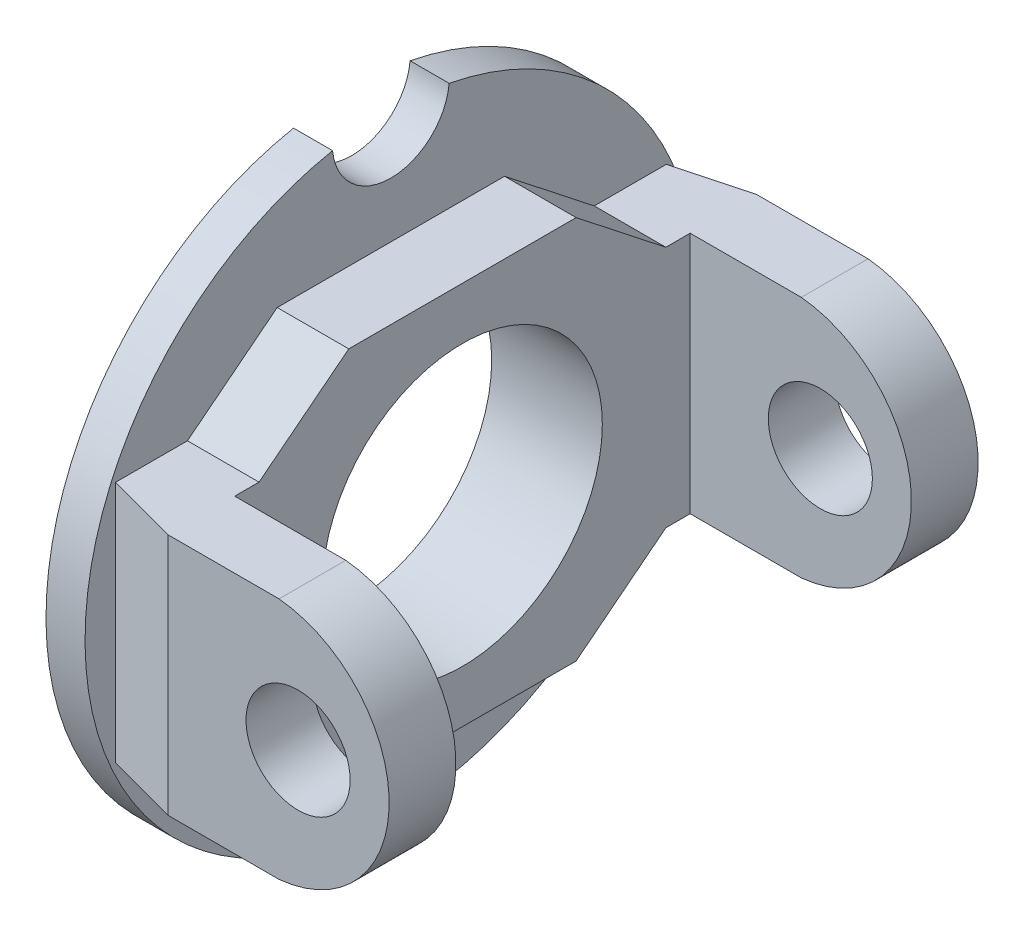
ISO-10303-21;
HEADER;
FILE_DESCRIPTION(('STEP AP214'),'2;1');
FILE_NAME('part.step','',(''),(''),'','','');
FILE_SCHEMA(('AUTOMOTIVE_DESIGN { 1 0 10303 214 1 1 1 1 }'));
ENDSEC;
DATA;
#1=APPLICATION_CONTEXT('core data for automotive mechanical design processes');
#2=APPLICATION_PROTOCOL_DEFINITION('international standard','automotive_design',2000,#1);
#3=PRODUCT_CONTEXT('',#1,'mechanical');
#4=PRODUCT('Part','Part','',(#3));
#5=PRODUCT_RELATED_PRODUCT_CATEGORY('part','',(#4));
#6=PRODUCT_DEFINITION_FORMATION('','',#4);
#7=PRODUCT_DEFINITION_CONTEXT('part definition',#1,'design');
#8=PRODUCT_DEFINITION('design','',#6,#7);
#9=PRODUCT_DEFINITION_SHAPE('','',#8);
#10=(LENGTH_UNIT() NAMED_UNIT(*) SI_UNIT(.MILLI.,.METRE.));
#11=(NAMED_UNIT(*) PLANE_ANGLE_UNIT() SI_UNIT($,.RADIAN.));
#12=(NAMED_UNIT(*) SI_UNIT($,.STERADIAN.) SOLID_ANGLE_UNIT());
#13=UNCERTAINTY_MEASURE_WITH_UNIT(LENGTH_MEASURE(1.E-05),#10,'distance_accuracy_value','');
#14=(GEOMETRIC_REPRESENTATION_CONTEXT(3) GLOBAL_UNCERTAINTY_ASSIGNED_CONTEXT((#13)) GLOBAL_UNIT_ASSIGNED_CONTEXT((#10,
#11,#12)) REPRESENTATION_CONTEXT('',''));
#15=CARTESIAN_POINT('',(0.,0.,0.));
#16=DIRECTION('',(0.,0.,1.));
#17=DIRECTION('',(1.,0.,0.));
#18=AXIS2_PLACEMENT_3D('',#15,#16,#17);
#19=CARTESIAN_POINT('',(25.5,9.335,22.63));
#20=DIRECTION('',(0.,0.,-1.));
#21=DIRECTION('',(-1.,0.,0.));
#22=AXIS2_PLACEMENT_3D('',#19,#20,#21);
#23=PLANE('',#22);
#24=CARTESIAN_POINT('',(18.5,0.,22.63));
#25=DIRECTION('',(0.,0.,1.));
#26=DIRECTION('',(1.,0.,0.));
#27=AXIS2_PLACEMENT_3D('',#24,#25,#26);
#28=CIRCLE('',#27,4.);
#29=CARTESIAN_POINT('',(22.5,0.,22.63));
#30=VERTEX_POINT('',#29);
#31=EDGE_CURVE('E662',#30,#30,#28,.T.);
#32=ORIENTED_EDGE('',*,*,#31,.F.);
#33=EDGE_LOOP('',(#32));
#34=FACE_BOUND('',#33,.T.);
#35=DIRECTION('',(-1.,0.,0.));
#36=VECTOR('',#35,1.);
#37=CARTESIAN_POINT('',(25.5,-9.335,22.63));
#38=LINE('',#37,#36);
#39=CARTESIAN_POINT('',(17.0377009316765,-9.335,22.63));
#40=VERTEX_POINT('',#39);
#41=CARTESIAN_POINT('',(8.5,-9.335,22.63));
#42=VERTEX_POINT('',#41);
#43=EDGE_CURVE('E183',#40,#42,#38,.T.);
#44=ORIENTED_EDGE('',*,*,#43,.F.);
#45=CARTESIAN_POINT('',(16.12,0.,22.63));
#46=DIRECTION('',(0.,0.,-1.));
#47=DIRECTION('',(-1.,0.,0.));
#48=AXIS2_PLACEMENT_3D('',#45,#46,#47);
#49=CIRCLE('',#48,9.38);
#50=CARTESIAN_POINT('',(17.0377009316765,9.335,22.63));
#51=VERTEX_POINT('',#50);
#52=EDGE_CURVE('E177',#51,#40,#49,.T.);
#53=ORIENTED_EDGE('',*,*,#52,.F.);
#54=DIRECTION('',(-1.,0.,0.));
#55=VECTOR('',#54,1.);
#56=CARTESIAN_POINT('',(25.5,9.335,22.63));
#57=LINE('',#56,#55);
#58=CARTESIAN_POINT('',(8.5,9.335,22.63));
#59=VERTEX_POINT('',#58);
#60=EDGE_CURVE('E181',#51,#59,#57,.T.);
#61=ORIENTED_EDGE('',*,*,#60,.T.);
#62=DIRECTION('',(0.,-1.,0.));
#63=VECTOR('',#62,1.);
#64=CARTESIAN_POINT('',(8.5,0.,22.63));
#65=LINE('',#64,#63);
#66=EDGE_CURVE('E214',#59,#42,#65,.T.);
#67=ORIENTED_EDGE('',*,*,#66,.T.);
#68=EDGE_LOOP('',(#44,#53,#61,#67));
#69=FACE_BOUND('',#68,.T.);
#70=ADVANCED_FACE('F40',(#34,#69),#23,.F.);
#71=CARTESIAN_POINT('',(25.5,9.335,17.5));
#72=DIRECTION('',(0.,0.,1.));
#73=DIRECTION('',(0.,-1.,0.));
#74=AXIS2_PLACEMENT_3D('',#71,#72,#73);
#75=PLANE('',#74);
#76=CARTESIAN_POINT('',(18.5,0.,17.5));
#77=DIRECTION('',(0.,0.,1.));
#78=DIRECTION('',(0.,-1.,0.));
#79=AXIS2_PLACEMENT_3D('',#76,#77,#78);
#80=CIRCLE('',#79,4.);
#81=CARTESIAN_POINT('',(18.5,-4.,17.5));
#82=VERTEX_POINT('',#81);
#83=EDGE_CURVE('E187',#82,#82,#80,.T.);
#84=ORIENTED_EDGE('',*,*,#83,.T.);
#85=EDGE_LOOP('',(#84));
#86=FACE_BOUND('',#85,.T.);
#87=DIRECTION('',(-1.,0.,0.));
#88=VECTOR('',#87,1.);
#89=CARTESIAN_POINT('',(25.5,9.335,17.5));
#90=LINE('',#89,#88);
#91=CARTESIAN_POINT('',(17.0377009316765,9.335,17.5));
#92=VERTEX_POINT('',#91);
#93=CARTESIAN_POINT('',(8.5,9.335,17.5));
#94=VERTEX_POINT('',#93);
#95=EDGE_CURVE('E199',#92,#94,#90,.T.);
#96=ORIENTED_EDGE('',*,*,#95,.F.);
#97=CARTESIAN_POINT('',(16.12,0.,17.5));
#98=DIRECTION('',(0.,0.,1.));
#99=DIRECTION('',(0.,-1.,0.));
#100=AXIS2_PLACEMENT_3D('',#97,#98,#99);
#101=CIRCLE('',#100,9.38);
#102=CARTESIAN_POINT('',(17.0377009316765,-9.335,17.5));
#103=VERTEX_POINT('',#102);
#104=EDGE_CURVE('E57',#92,#103,#101,.F.);
#105=ORIENTED_EDGE('',*,*,#104,.T.);
#106=DIRECTION('',(-1.,0.,0.));
#107=VECTOR('',#106,1.);
#108=CARTESIAN_POINT('',(25.5,-9.335,17.5));
#109=LINE('',#108,#107);
#110=CARTESIAN_POINT('',(8.5,-9.335,17.5));
#111=VERTEX_POINT('',#110);
#112=EDGE_CURVE('E202',#103,#111,#109,.T.);
#113=ORIENTED_EDGE('',*,*,#112,.T.);
#114=DIRECTION('',(0.,1.,0.));
#115=VECTOR('',#114,1.);
#116=CARTESIAN_POINT('',(8.5,9.335,17.5));
#117=LINE('',#116,#115);
#118=EDGE_CURVE('E200',#111,#94,#117,.T.);
#119=ORIENTED_EDGE('',*,*,#118,.T.);
#120=EDGE_LOOP('',(#96,#105,#113,#119));
#121=FACE_BOUND('',#120,.T.);
#122=ADVANCED_FACE('F386',(#86,#121),#75,.F.);
#123=CARTESIAN_POINT('',(25.5,9.335,-22.63));
#124=DIRECTION('',(0.,0.,1.));
#125=DIRECTION('',(1.,0.,0.));
#126=AXIS2_PLACEMENT_3D('',#123,#124,#125);
#127=PLANE('',#126);
#128=CARTESIAN_POINT('',(18.5,0.,-22.63));
#129=DIRECTION('',(0.,0.,1.));
#130=DIRECTION('',(1.,0.,0.));
#131=AXIS2_PLACEMENT_3D('',#128,#129,#130);
#132=CIRCLE('',#131,4.);
#133=CARTESIAN_POINT('',(22.5,0.,-22.63));
#134=VERTEX_POINT('',#133);
#135=EDGE_CURVE('E665',#134,#134,#132,.F.);
#136=ORIENTED_EDGE('',*,*,#135,.F.);
#137=EDGE_LOOP('',(#136));
#138=FACE_BOUND('',#137,.T.);
#139=DIRECTION('',(-1.,0.,0.));
#140=VECTOR('',#139,1.);
#141=CARTESIAN_POINT('',(25.5,9.335,-22.63));
#142=LINE('',#141,#140);
#143=CARTESIAN_POINT('',(17.0377009316765,9.335,-22.63));
#144=VERTEX_POINT('',#143);
#145=CARTESIAN_POINT('',(8.5,9.335,-22.63));
#146=VERTEX_POINT('',#145);
#147=EDGE_CURVE('E205',#144,#146,#142,.T.);
#148=ORIENTED_EDGE('',*,*,#147,.F.);
#149=CARTESIAN_POINT('',(16.12,0.,-22.63));
#150=DIRECTION('',(0.,0.,1.));
#151=DIRECTION('',(1.,0.,0.));
#152=AXIS2_PLACEMENT_3D('',#149,#150,#151);
#153=CIRCLE('',#152,9.38);
#154=CARTESIAN_POINT('',(17.0377009316765,-9.335,-22.63));
#155=VERTEX_POINT('',#154);
#156=EDGE_CURVE('E335',#155,#144,#153,.T.);
#157=ORIENTED_EDGE('',*,*,#156,.F.);
#158=DIRECTION('',(-1.,0.,0.));
#159=VECTOR('',#158,1.);
#160=CARTESIAN_POINT('',(25.5,-9.335,-22.63));
#161=LINE('',#160,#159);
#162=CARTESIAN_POINT('',(8.5,-9.335,-22.63));
#163=VERTEX_POINT('',#162);
#164=EDGE_CURVE('E344',#155,#163,#161,.T.);
#165=ORIENTED_EDGE('',*,*,#164,.T.);
#166=DIRECTION('',(0.,-1.,0.));
#167=VECTOR('',#166,1.);
#168=CARTESIAN_POINT('',(8.5,0.,-22.63));
#169=LINE('',#168,#167);
#170=EDGE_CURVE('E228',#146,#163,#169,.T.);
#171=ORIENTED_EDGE('',*,*,#170,.F.);
#172=EDGE_LOOP('',(#148,#157,#165,#171));
#173=FACE_BOUND('',#172,.T.);
#174=ADVANCED_FACE('F362',(#138,#173),#127,.F.);
#175=CARTESIAN_POINT('',(25.5,9.335,-17.5));
#176=DIRECTION('',(0.,0.,-1.));
#177=DIRECTION('',(0.,1.,0.));
#178=AXIS2_PLACEMENT_3D('',#175,#176,#177);
#179=PLANE('',#178);
#180=CARTESIAN_POINT('',(18.5,0.,-17.5));
#181=DIRECTION('',(0.,0.,-1.));
#182=DIRECTION('',(0.,1.,0.));
#183=AXIS2_PLACEMENT_3D('',#180,#181,#182);
#184=CIRCLE('',#183,4.);
#185=CARTESIAN_POINT('',(18.5,4.,-17.5));
#186=VERTEX_POINT('',#185);
#187=EDGE_CURVE('E44',#186,#186,#184,.T.);
#188=ORIENTED_EDGE('',*,*,#187,.T.);
#189=EDGE_LOOP('',(#188));
#190=FACE_BOUND('',#189,.T.);
#191=DIRECTION('',(-1.,0.,0.));
#192=VECTOR('',#191,1.);
#193=CARTESIAN_POINT('',(25.5,-9.335,-17.5));
#194=LINE('',#193,#192);
#195=CARTESIAN_POINT('',(17.0377009316765,-9.335,-17.5));
#196=VERTEX_POINT('',#195);
#197=CARTESIAN_POINT('',(8.5,-9.335,-17.5));
#198=VERTEX_POINT('',#197);
#199=EDGE_CURVE('E346',#196,#198,#194,.T.);
#200=ORIENTED_EDGE('',*,*,#199,.F.);
#201=CARTESIAN_POINT('',(16.12,0.,-17.5));
#202=DIRECTION('',(0.,0.,-1.));
#203=DIRECTION('',(0.,1.,0.));
#204=AXIS2_PLACEMENT_3D('',#201,#202,#203);
#205=CIRCLE('',#204,9.38);
#206=CARTESIAN_POINT('',(17.0377009316765,9.335,-17.5));
#207=VERTEX_POINT('',#206);
#208=EDGE_CURVE('E65',#196,#207,#205,.F.);
#209=ORIENTED_EDGE('',*,*,#208,.T.);
#210=DIRECTION('',(-1.,0.,0.));
#211=VECTOR('',#210,1.);
#212=CARTESIAN_POINT('',(25.5,9.335,-17.5));
#213=LINE('',#212,#211);
#214=CARTESIAN_POINT('',(8.5,9.335,-17.5));
#215=VERTEX_POINT('',#214);
#216=EDGE_CURVE('E348',#207,#215,#213,.T.);
#217=ORIENTED_EDGE('',*,*,#216,.T.);
#218=DIRECTION('',(0.,-1.,0.));
#219=VECTOR('',#218,1.);
#220=CARTESIAN_POINT('',(8.5,9.335,-17.5));
#221=LINE('',#220,#219);
#222=EDGE_CURVE('E341',#215,#198,#221,.T.);
#223=ORIENTED_EDGE('',*,*,#222,.T.);
#224=EDGE_LOOP('',(#200,#209,#217,#223));
#225=FACE_BOUND('',#224,.T.);
#226=ADVANCED_FACE('F401',(#190,#225),#179,.F.);
#227=CARTESIAN_POINT('',(8.5,0.,0.));
#228=DIRECTION('',(1.,0.,0.));
#229=DIRECTION('',(0.,0.,-1.));
#230=AXIS2_PLACEMENT_3D('',#227,#228,#229);
#231=PLANE('',#230);
#232=CARTESIAN_POINT('',(8.5,0.,0.));
#233=DIRECTION('',(1.,0.,0.));
#234=DIRECTION('',(0.,0.,-1.));
#235=AXIS2_PLACEMENT_3D('',#232,#233,#234);
#236=CIRCLE('',#235,10.75);
#237=CARTESIAN_POINT('',(8.5,0.,-10.75));
#238=VERTEX_POINT('',#237);
#239=EDGE_CURVE('E243',#238,#238,#236,.F.);
#240=ORIENTED_EDGE('',*,*,#239,.T.);
#241=EDGE_LOOP('',(#240));
#242=FACE_BOUND('',#241,.T.);
#243=DIRECTION('',(0.,0.,-1.));
#244=VECTOR('',#243,1.);
#245=CARTESIAN_POINT('',(8.5,-9.335,0.));
#246=LINE('',#245,#244);
#247=CARTESIAN_POINT('',(8.5,-9.335,-15.63));
#248=VERTEX_POINT('',#247);
#249=EDGE_CURVE('E225',#248,#198,#246,.T.);
#250=ORIENTED_EDGE('',*,*,#249,.T.);
#251=ORIENTED_EDGE('',*,*,#222,.F.);
#252=DIRECTION('',(0.,0.,-1.));
#253=VECTOR('',#252,1.);
#254=CARTESIAN_POINT('',(8.5,9.335,0.));
#255=LINE('',#254,#253);
#256=CARTESIAN_POINT('',(8.5,9.335,-15.63));
#257=VERTEX_POINT('',#256);
#258=EDGE_CURVE('E231',#257,#215,#255,.T.);
#259=ORIENTED_EDGE('',*,*,#258,.F.);
#260=DIRECTION('',(0.,-0.617968363568924,-0.786202964652224));
#261=VECTOR('',#260,1.);
#262=CARTESIAN_POINT('',(8.5,13.3639174586689,-10.50425726448));
#263=LINE('',#262,#261);
#264=CARTESIAN_POINT('',(8.5,14.7545825484995,-8.735));
#265=VERTEX_POINT('',#264);
#266=EDGE_CURVE('E234',#265,#257,#263,.T.);
#267=ORIENTED_EDGE('',*,*,#266,.F.);
#268=DIRECTION('',(0.,0.,-1.));
#269=VECTOR('',#268,1.);
#270=CARTESIAN_POINT('',(8.5,14.7545825484995,0.));
#271=LINE('',#270,#269);
#272=CARTESIAN_POINT('',(8.5,14.7545825484995,8.735));
#273=VERTEX_POINT('',#272);
#274=EDGE_CURVE('E237',#273,#265,#271,.T.);
#275=ORIENTED_EDGE('',*,*,#274,.F.);
#276=DIRECTION('',(0.,0.617968363568924,-0.786202964652224));
#277=VECTOR('',#276,1.);
#278=CARTESIAN_POINT('',(8.5,13.3639174586689,10.50425726448));
#279=LINE('',#278,#277);
#280=CARTESIAN_POINT('',(8.5,9.335,15.63));
#281=VERTEX_POINT('',#280);
#282=EDGE_CURVE('E240',#281,#273,#279,.T.);
#283=ORIENTED_EDGE('',*,*,#282,.F.);
#284=DIRECTION('',(0.,0.,-1.));
#285=VECTOR('',#284,1.);
#286=CARTESIAN_POINT('',(8.5,9.335,0.));
#287=LINE('',#286,#285);
#288=EDGE_CURVE('E212',#94,#281,#287,.T.);
#289=ORIENTED_EDGE('',*,*,#288,.F.);
#290=ORIENTED_EDGE('',*,*,#118,.F.);
#291=DIRECTION('',(0.,0.,-1.));
#292=VECTOR('',#291,1.);
#293=CARTESIAN_POINT('',(8.5,-9.335,0.));
#294=LINE('',#293,#292);
#295=CARTESIAN_POINT('',(8.5,-9.335,15.63));
#296=VERTEX_POINT('',#295);
#297=EDGE_CURVE('E217',#111,#296,#294,.T.);
#298=ORIENTED_EDGE('',*,*,#297,.T.);
#299=DIRECTION('',(0.,-0.617968363568924,-0.786202964652224));
#300=VECTOR('',#299,1.);
#301=CARTESIAN_POINT('',(8.5,-13.3639174586689,10.50425726448));
#302=LINE('',#301,#300);
#303=CARTESIAN_POINT('',(8.5,-14.7545825484995,8.735));
#304=VERTEX_POINT('',#303);
#305=EDGE_CURVE('E219',#296,#304,#302,.T.);
#306=ORIENTED_EDGE('',*,*,#305,.T.);
#307=DIRECTION('',(0.,0.,-1.));
#308=VECTOR('',#307,1.);
#309=CARTESIAN_POINT('',(8.5,-14.7545825484995,0.));
#310=LINE('',#309,#308);
#311=CARTESIAN_POINT('',(8.5,-14.7545825484995,-8.735));
#312=VERTEX_POINT('',#311);
#313=EDGE_CURVE('E221',#304,#312,#310,.T.);
#314=ORIENTED_EDGE('',*,*,#313,.T.);
#315=DIRECTION('',(0.,0.617968363568925,-0.786202964652224));
#316=VECTOR('',#315,1.);
#317=CARTESIAN_POINT('',(8.5,-13.3639174586689,-10.50425726448));
#318=LINE('',#317,#316);
#319=EDGE_CURVE('E223',#312,#248,#318,.T.);
#320=ORIENTED_EDGE('',*,*,#319,.T.);
#321=EDGE_LOOP('',(#250,#251,#259,#267,#275,#283,#289,#290,#298,#306,#314,#320));
#322=FACE_BOUND('',#321,.T.);
#323=ADVANCED_FACE('F383',(#242,#322),#231,.T.);
#324=CARTESIAN_POINT('',(3.,11.75,0.));
#325=DIRECTION('',(1.,0.,0.));
#326=DIRECTION('',(0.,0.,-1.));
#327=AXIS2_PLACEMENT_3D('',#324,#325,#326);
#328=PLANE('',#327);
#329=DIRECTION('',(0.,0.,-1.));
#330=VECTOR('',#329,1.);
#331=CARTESIAN_POINT('',(3.,-9.335,0.));
#332=LINE('',#331,#330);
#333=CARTESIAN_POINT('',(3.,-9.335,21.1562794416288));
#334=VERTEX_POINT('',#333);
#335=CARTESIAN_POINT('',(3.,-9.335,15.63));
#336=VERTEX_POINT('',#335);
#337=EDGE_CURVE('E247',#334,#336,#332,.T.);
#338=ORIENTED_EDGE('',*,*,#337,.F.);
#339=DIRECTION('',(0.,1.,0.));
#340=VECTOR('',#339,1.);
#341=CARTESIAN_POINT('',(3.,0.,21.1562794416288));
#342=LINE('',#341,#340);
#343=CARTESIAN_POINT('',(3.,9.335,21.1562794416288));
#344=VERTEX_POINT('',#343);
#345=EDGE_CURVE('E249',#344,#334,#342,.F.);
#346=ORIENTED_EDGE('',*,*,#345,.F.);
#347=DIRECTION('',(0.,0.,-1.));
#348=VECTOR('',#347,1.);
#349=CARTESIAN_POINT('',(3.,9.335,0.));
#350=LINE('',#349,#348);
#351=CARTESIAN_POINT('',(3.,9.335,15.63));
#352=VERTEX_POINT('',#351);
#353=EDGE_CURVE('E11',#344,#352,#350,.T.);
#354=ORIENTED_EDGE('',*,*,#353,.T.);
#355=DIRECTION('',(0.,0.617968363568924,-0.786202964652224));
#356=VECTOR('',#355,1.);
#357=CARTESIAN_POINT('',(3.,13.3639174586689,10.50425726448));
#358=LINE('',#357,#356);
#359=CARTESIAN_POINT('',(3.,14.7545825484995,8.735));
#360=VERTEX_POINT('',#359);
#361=EDGE_CURVE('E215',#352,#360,#358,.T.);
#362=ORIENTED_EDGE('',*,*,#361,.T.);
#363=DIRECTION('',(0.,0.,-1.));
#364=VECTOR('',#363,1.);
#365=CARTESIAN_POINT('',(3.,14.7545825484995,0.));
#366=LINE('',#365,#364);
#367=CARTESIAN_POINT('',(3.,14.7545825484995,-8.735));
#368=VERTEX_POINT('',#367);
#369=EDGE_CURVE('E266',#360,#368,#366,.T.);
#370=ORIENTED_EDGE('',*,*,#369,.T.);
#371=DIRECTION('',(0.,-0.617968363568924,-0.786202964652224));
#372=VECTOR('',#371,1.);
#373=CARTESIAN_POINT('',(3.,13.3639174586689,-10.50425726448));
#374=LINE('',#373,#372);
#375=CARTESIAN_POINT('',(3.,9.335,-15.63));
#376=VERTEX_POINT('',#375);
#377=EDGE_CURVE('E263',#368,#376,#374,.T.);
#378=ORIENTED_EDGE('',*,*,#377,.T.);
#379=DIRECTION('',(0.,0.,-1.));
#380=VECTOR('',#379,1.);
#381=CARTESIAN_POINT('',(3.,9.335,0.));
#382=LINE('',#381,#380);
#383=CARTESIAN_POINT('',(3.,9.335,-21.1562794416288));
#384=VERTEX_POINT('',#383);
#385=EDGE_CURVE('E261',#376,#384,#382,.T.);
#386=ORIENTED_EDGE('',*,*,#385,.T.);
#387=DIRECTION('',(0.,-1.,0.));
#388=VECTOR('',#387,1.);
#389=CARTESIAN_POINT('',(3.,0.,-21.1562794416288));
#390=LINE('',#389,#388);
#391=CARTESIAN_POINT('',(3.,-9.33499999999999,-21.1562794416288));
#392=VERTEX_POINT('',#391);
#393=EDGE_CURVE('E49',#384,#392,#390,.T.);
#394=ORIENTED_EDGE('',*,*,#393,.T.);
#395=DIRECTION('',(0.,0.,-1.));
#396=VECTOR('',#395,1.);
#397=CARTESIAN_POINT('',(3.,-9.335,0.));
#398=LINE('',#397,#396);
#399=CARTESIAN_POINT('',(3.,-9.335,-15.63));
#400=VERTEX_POINT('',#399);
#401=EDGE_CURVE('E258',#400,#392,#398,.T.);
#402=ORIENTED_EDGE('',*,*,#401,.F.);
#403=DIRECTION('',(0.,0.617968363568925,-0.786202964652224));
#404=VECTOR('',#403,1.);
#405=CARTESIAN_POINT('',(3.,-13.3639174586689,-10.50425726448));
#406=LINE('',#405,#404);
#407=CARTESIAN_POINT('',(3.,-14.7545825484995,-8.735));
#408=VERTEX_POINT('',#407);
#409=EDGE_CURVE('E255',#408,#400,#406,.T.);
#410=ORIENTED_EDGE('',*,*,#409,.F.);
#411=DIRECTION('',(0.,0.,-1.));
#412=VECTOR('',#411,1.);
#413=CARTESIAN_POINT('',(3.,-14.7545825484995,0.));
#414=LINE('',#413,#412);
#415=CARTESIAN_POINT('',(3.,-14.7545825484995,8.735));
#416=VERTEX_POINT('',#415);
#417=EDGE_CURVE('E252',#416,#408,#414,.T.);
#418=ORIENTED_EDGE('',*,*,#417,.F.);
#419=DIRECTION('',(0.,-0.617968363568924,-0.786202964652224));
#420=VECTOR('',#419,1.);
#421=CARTESIAN_POINT('',(3.,-13.3639174586689,10.50425726448));
#422=LINE('',#421,#420);
#423=EDGE_CURVE('E211',#336,#416,#422,.T.);
#424=ORIENTED_EDGE('',*,*,#423,.F.);
#425=EDGE_LOOP('',(#338,#346,#354,#362,#370,#378,#386,#394,#402,#410,#418,#424));
#426=FACE_BOUND('',#425,.T.);
#427=CARTESIAN_POINT('',(3.,0.,0.));
#428=DIRECTION('',(1.,0.,0.));
#429=DIRECTION('',(0.,0.,-1.));
#430=AXIS2_PLACEMENT_3D('',#427,#428,#429);
#431=CIRCLE('',#430,23.5);
#432=CARTESIAN_POINT('',(3.,23.0691489361702,4.479326663774));
#433=VERTEX_POINT('',#432);
#434=CARTESIAN_POINT('',(3.,23.0691489361702,-4.47932666377399));
#435=VERTEX_POINT('',#434);
#436=EDGE_CURVE('E302',#433,#435,#431,.T.);
#437=ORIENTED_EDGE('',*,*,#436,.T.);
#438=CARTESIAN_POINT('',(3.,23.5,0.));
#439=DIRECTION('',(-1.,0.,0.));
#440=DIRECTION('',(0.,0.,-1.));
#441=AXIS2_PLACEMENT_3D('',#438,#439,#440);
#442=CIRCLE('',#441,4.5);
#443=EDGE_CURVE('E299',#435,#433,#442,.T.);
#444=ORIENTED_EDGE('',*,*,#443,.T.);
#445=EDGE_LOOP('',(#437,#444));
#446=FACE_BOUND('',#445,.T.);
#447=ADVANCED_FACE('F368',(#426,#446),#328,.T.);
#448=CARTESIAN_POINT('',(0.,11.75,0.));
#449=DIRECTION('',(1.,0.,0.));
#450=DIRECTION('',(0.,0.,-1.));
#451=AXIS2_PLACEMENT_3D('',#448,#449,#450);
#452=PLANE('',#451);
#453=CARTESIAN_POINT('',(0.,23.5,0.));
#454=DIRECTION('',(-1.,0.,0.));
#455=DIRECTION('',(0.,0.,-1.));
#456=AXIS2_PLACEMENT_3D('',#453,#454,#455);
#457=CIRCLE('',#456,4.5);
#458=CARTESIAN_POINT('',(0.,23.0691489361702,-4.47932666377399));
#459=VERTEX_POINT('',#458);
#460=CARTESIAN_POINT('',(0.,23.0691489361702,4.479326663774));
#461=VERTEX_POINT('',#460);
#462=EDGE_CURVE('E298',#459,#461,#457,.T.);
#463=ORIENTED_EDGE('',*,*,#462,.F.);
#464=CARTESIAN_POINT('',(0.,0.,0.));
#465=DIRECTION('',(1.,0.,0.));
#466=DIRECTION('',(0.,0.,-1.));
#467=AXIS2_PLACEMENT_3D('',#464,#465,#466);
#468=CIRCLE('',#467,23.5);
#469=EDGE_CURVE('E303',#461,#459,#468,.T.);
#470=ORIENTED_EDGE('',*,*,#469,.F.);
#471=EDGE_LOOP('',(#463,#470));
#472=FACE_BOUND('',#471,.T.);
#473=CARTESIAN_POINT('',(0.,0.,0.));
#474=DIRECTION('',(1.,0.,0.));
#475=DIRECTION('',(0.,0.,-1.));
#476=AXIS2_PLACEMENT_3D('',#473,#474,#475);
#477=CIRCLE('',#476,10.75);
#478=CARTESIAN_POINT('',(0.,0.,-10.75));
#479=VERTEX_POINT('',#478);
#480=EDGE_CURVE('E295',#479,#479,#477,.T.);
#481=ORIENTED_EDGE('',*,*,#480,.T.);
#482=EDGE_LOOP('',(#481));
#483=FACE_BOUND('',#482,.T.);
#484=ADVANCED_FACE('F453',(#472,#483),#452,.F.);
#485=CARTESIAN_POINT('',(3.,23.5,0.));
#486=DIRECTION('',(-1.,0.,0.));
#487=DIRECTION('',(0.,0.,1.));
#488=AXIS2_PLACEMENT_3D('',#485,#486,#487);
#489=CYLINDRICAL_SURFACE('',#488,4.5);
#490=ORIENTED_EDGE('',*,*,#462,.T.);
#491=DIRECTION('',(-1.,0.,0.));
#492=VECTOR('',#491,1.);
#493=CARTESIAN_POINT('',(3.,23.0691489361702,4.479326663774));
#494=LINE('',#493,#492);
#495=EDGE_CURVE('E311',#433,#461,#494,.T.);
#496=ORIENTED_EDGE('',*,*,#495,.F.);
#497=ORIENTED_EDGE('',*,*,#443,.F.);
#498=DIRECTION('',(-1.,0.,0.));
#499=VECTOR('',#498,1.);
#500=CARTESIAN_POINT('',(3.,23.0691489361702,-4.47932666377399));
#501=LINE('',#500,#499);
#502=EDGE_CURVE('E305',#435,#459,#501,.T.);
#503=ORIENTED_EDGE('',*,*,#502,.T.);
#504=EDGE_LOOP('',(#490,#496,#497,#503));
#505=FACE_BOUND('',#504,.T.);
#506=ADVANCED_FACE('F456',(#505),#489,.F.);
#507=CARTESIAN_POINT('',(3.,0.,0.));
#508=DIRECTION('',(-1.,0.,0.));
#509=DIRECTION('',(0.,0.,1.));
#510=AXIS2_PLACEMENT_3D('',#507,#508,#509);
#511=CYLINDRICAL_SURFACE('',#510,23.5);
#512=ORIENTED_EDGE('',*,*,#469,.T.);
#513=ORIENTED_EDGE('',*,*,#502,.F.);
#514=ORIENTED_EDGE('',*,*,#436,.F.);
#515=ORIENTED_EDGE('',*,*,#495,.T.);
#516=EDGE_LOOP('',(#512,#513,#514,#515));
#517=FACE_BOUND('',#516,.T.);
#518=ADVANCED_FACE('F449',(#517),#511,.T.);
#519=CARTESIAN_POINT('',(3.,0.,0.));
#520=DIRECTION('',(-1.,0.,0.));
#521=DIRECTION('',(0.,0.,1.));
#522=AXIS2_PLACEMENT_3D('',#519,#520,#521);
#523=CYLINDRICAL_SURFACE('',#522,10.75);
#524=ORIENTED_EDGE('',*,*,#480,.F.);
#525=EDGE_LOOP('',(#524));
#526=FACE_BOUND('',#525,.T.);
#527=ORIENTED_EDGE('',*,*,#239,.F.);
#528=EDGE_LOOP('',(#527));
#529=FACE_BOUND('',#528,.T.);
#530=ADVANCED_FACE('F446',(#526,#529),#523,.F.);
#531=CARTESIAN_POINT('',(8.5,9.335,0.));
#532=DIRECTION('',(0.,1.,0.));
#533=DIRECTION('',(0.,0.,1.));
#534=AXIS2_PLACEMENT_3D('',#531,#532,#533);
#535=PLANE('',#534);
#536=DIRECTION('',(0.,0.,1.));
#537=VECTOR('',#536,1.);
#538=CARTESIAN_POINT('',(17.0377009316765,9.335,-51.4257375317945));
#539=LINE('',#538,#537);
#540=EDGE_CURVE('E186',#92,#51,#539,.T.);
#541=ORIENTED_EDGE('',*,*,#540,.F.);
#542=ORIENTED_EDGE('',*,*,#95,.T.);
#543=ORIENTED_EDGE('',*,*,#288,.T.);
#544=DIRECTION('',(-1.,0.,0.));
#545=VECTOR('',#544,1.);
#546=CARTESIAN_POINT('',(8.5,9.335,15.63));
#547=LINE('',#546,#545);
#548=EDGE_CURVE('E245',#281,#352,#547,.T.);
#549=ORIENTED_EDGE('',*,*,#548,.T.);
#550=ORIENTED_EDGE('',*,*,#353,.F.);
#551=DIRECTION('',(0.965925826289068,0.,0.258819045102521));
#552=VECTOR('',#551,1.);
#553=CARTESIAN_POINT('',(2.84249999999999,9.335,21.1140774438209));
#554=LINE('',#553,#552);
#555=EDGE_CURVE('E197',#59,#344,#554,.F.);
#556=ORIENTED_EDGE('',*,*,#555,.F.);
#557=ORIENTED_EDGE('',*,*,#60,.F.);
#558=EDGE_LOOP('',(#541,#542,#543,#549,#550,#556,#557));
#559=FACE_BOUND('',#558,.T.);
#560=ADVANCED_FACE('F194',(#559),#535,.T.);
#561=CARTESIAN_POINT('',(8.5,0.,22.63));
#562=DIRECTION('',(-0.258819045102521,0.,0.965925826289068));
#563=DIRECTION('',(0.965925826289068,0.,0.258819045102521));
#564=AXIS2_PLACEMENT_3D('',#561,#562,#563);
#565=PLANE('',#564);
#566=ORIENTED_EDGE('',*,*,#555,.T.);
#567=ORIENTED_EDGE('',*,*,#345,.T.);
#568=DIRECTION('',(0.965925826289068,0.,0.258819045102521));
#569=VECTOR('',#568,1.);
#570=CARTESIAN_POINT('',(2.84249999999999,-9.335,21.1140774438209));
#571=LINE('',#570,#569);
#572=EDGE_CURVE('E294',#42,#334,#571,.F.);
#573=ORIENTED_EDGE('',*,*,#572,.F.);
#574=ORIENTED_EDGE('',*,*,#66,.F.);
#575=EDGE_LOOP('',(#566,#567,#573,#574));
#576=FACE_BOUND('',#575,.T.);
#577=ADVANCED_FACE('F42',(#576),#565,.T.);
#578=CARTESIAN_POINT('',(8.5,-9.335,0.));
#579=DIRECTION('',(0.,1.,0.));
#580=DIRECTION('',(0.,0.,1.));
#581=AXIS2_PLACEMENT_3D('',#578,#579,#580);
#582=PLANE('',#581);
#583=ORIENTED_EDGE('',*,*,#112,.F.);
#584=DIRECTION('',(0.,0.,1.));
#585=VECTOR('',#584,1.);
#586=CARTESIAN_POINT('',(17.0377009316765,-9.335,-51.4257375317945));
#587=LINE('',#586,#585);
#588=EDGE_CURVE('E330',#103,#40,#587,.T.);
#589=ORIENTED_EDGE('',*,*,#588,.T.);
#590=ORIENTED_EDGE('',*,*,#43,.T.);
#591=ORIENTED_EDGE('',*,*,#572,.T.);
#592=ORIENTED_EDGE('',*,*,#337,.T.);
#593=DIRECTION('',(-1.,0.,0.));
#594=VECTOR('',#593,1.);
#595=CARTESIAN_POINT('',(8.5,-9.335,15.63));
#596=LINE('',#595,#594);
#597=EDGE_CURVE('E291',#296,#336,#596,.T.);
#598=ORIENTED_EDGE('',*,*,#597,.F.);
#599=ORIENTED_EDGE('',*,*,#297,.F.);
#600=EDGE_LOOP('',(#583,#589,#590,#591,#592,#598,#599));
#601=FACE_BOUND('',#600,.T.);
#602=ADVANCED_FACE('F327',(#601),#582,.F.);
#603=CARTESIAN_POINT('',(8.5,-13.3639174586689,10.50425726448));
#604=DIRECTION('',(0.,0.786202964652224,-0.617968363568924));
#605=DIRECTION('',(0.,0.617968363568924,0.786202964652224));
#606=AXIS2_PLACEMENT_3D('',#603,#604,#605);
#607=PLANE('',#606);
#608=ORIENTED_EDGE('',*,*,#423,.T.);
#609=DIRECTION('',(-1.,0.,0.));
#610=VECTOR('',#609,1.);
#611=CARTESIAN_POINT('',(8.5,-14.7545825484995,8.735));
#612=LINE('',#611,#610);
#613=EDGE_CURVE('E288',#304,#416,#612,.T.);
#614=ORIENTED_EDGE('',*,*,#613,.F.);
#615=ORIENTED_EDGE('',*,*,#305,.F.);
#616=ORIENTED_EDGE('',*,*,#597,.T.);
#617=EDGE_LOOP('',(#608,#614,#615,#616));
#618=FACE_BOUND('',#617,.T.);
#619=ADVANCED_FACE('F379',(#618),#607,.F.);
#620=CARTESIAN_POINT('',(8.5,-14.7545825484995,0.));
#621=DIRECTION('',(0.,1.,0.));
#622=DIRECTION('',(0.,0.,1.));
#623=AXIS2_PLACEMENT_3D('',#620,#621,#622);
#624=PLANE('',#623);
#625=ORIENTED_EDGE('',*,*,#417,.T.);
#626=DIRECTION('',(-1.,0.,0.));
#627=VECTOR('',#626,1.);
#628=CARTESIAN_POINT('',(8.5,-14.7545825484995,-8.735));
#629=LINE('',#628,#627);
#630=EDGE_CURVE('E284',#312,#408,#629,.T.);
#631=ORIENTED_EDGE('',*,*,#630,.F.);
#632=ORIENTED_EDGE('',*,*,#313,.F.);
#633=ORIENTED_EDGE('',*,*,#613,.T.);
#634=EDGE_LOOP('',(#625,#631,#632,#633));
#635=FACE_BOUND('',#634,.T.);
#636=ADVANCED_FACE('F376',(#635),#624,.F.);
#637=CARTESIAN_POINT('',(8.5,-13.3639174586689,-10.50425726448));
#638=DIRECTION('',(0.,0.786202964652224,0.617968363568925));
#639=DIRECTION('',(0.,-0.617968363568925,0.786202964652224));
#640=AXIS2_PLACEMENT_3D('',#637,#638,#639);
#641=PLANE('',#640);
#642=ORIENTED_EDGE('',*,*,#409,.T.);
#643=DIRECTION('',(-1.,0.,0.));
#644=VECTOR('',#643,1.);
#645=CARTESIAN_POINT('',(8.5,-9.335,-15.63));
#646=LINE('',#645,#644);
#647=EDGE_CURVE('E281',#248,#400,#646,.T.);
#648=ORIENTED_EDGE('',*,*,#647,.F.);
#649=ORIENTED_EDGE('',*,*,#319,.F.);
#650=ORIENTED_EDGE('',*,*,#630,.T.);
#651=EDGE_LOOP('',(#642,#648,#649,#650));
#652=FACE_BOUND('',#651,.T.);
#653=ADVANCED_FACE('F371',(#652),#641,.F.);
#654=CARTESIAN_POINT('',(8.5,-9.335,0.));
#655=DIRECTION('',(0.,1.,0.));
#656=DIRECTION('',(0.,0.,1.));
#657=AXIS2_PLACEMENT_3D('',#654,#655,#656);
#658=PLANE('',#657);
#659=ORIENTED_EDGE('',*,*,#164,.F.);
#660=EDGE_CURVE('E332',#155,#196,#587,.T.);
#661=ORIENTED_EDGE('',*,*,#660,.T.);
#662=ORIENTED_EDGE('',*,*,#199,.T.);
#663=ORIENTED_EDGE('',*,*,#249,.F.);
#664=ORIENTED_EDGE('',*,*,#647,.T.);
#665=ORIENTED_EDGE('',*,*,#401,.T.);
#666=DIRECTION('',(-0.965925826289068,0.,0.258819045102521));
#667=VECTOR('',#666,1.);
#668=CARTESIAN_POINT('',(2.84249999999999,-9.335,-21.1140774438209));
#669=LINE('',#668,#667);
#670=EDGE_CURVE('E285',#163,#392,#669,.T.);
#671=ORIENTED_EDGE('',*,*,#670,.F.);
#672=EDGE_LOOP('',(#659,#661,#662,#663,#664,#665,#671));
#673=FACE_BOUND('',#672,.T.);
#674=ADVANCED_FACE('F365',(#673),#658,.F.);
#675=CARTESIAN_POINT('',(8.5,0.,-22.63));
#676=DIRECTION('',(-0.258819045102521,0.,-0.965925826289068));
#677=DIRECTION('',(-0.965925826289068,0.,0.258819045102521));
#678=AXIS2_PLACEMENT_3D('',#675,#676,#677);
#679=PLANE('',#678);
#680=ORIENTED_EDGE('',*,*,#670,.T.);
#681=ORIENTED_EDGE('',*,*,#393,.F.);
#682=DIRECTION('',(-0.965925826289068,0.,0.258819045102521));
#683=VECTOR('',#682,1.);
#684=CARTESIAN_POINT('',(2.84249999999999,9.335,-21.1140774438209));
#685=LINE('',#684,#683);
#686=EDGE_CURVE('E280',#146,#384,#685,.T.);
#687=ORIENTED_EDGE('',*,*,#686,.F.);
#688=ORIENTED_EDGE('',*,*,#170,.T.);
#689=EDGE_LOOP('',(#680,#681,#687,#688));
#690=FACE_BOUND('',#689,.T.);
#691=ADVANCED_FACE('F360',(#690),#679,.T.);
#692=CARTESIAN_POINT('',(8.5,9.335,0.));
#693=DIRECTION('',(0.,1.,0.));
#694=DIRECTION('',(0.,0.,1.));
#695=AXIS2_PLACEMENT_3D('',#692,#693,#694);
#696=PLANE('',#695);
#697=EDGE_CURVE('E192',#144,#207,#539,.T.);
#698=ORIENTED_EDGE('',*,*,#697,.F.);
#699=ORIENTED_EDGE('',*,*,#147,.T.);
#700=ORIENTED_EDGE('',*,*,#686,.T.);
#701=ORIENTED_EDGE('',*,*,#385,.F.);
#702=DIRECTION('',(-1.,0.,0.));
#703=VECTOR('',#702,1.);
#704=CARTESIAN_POINT('',(8.5,9.335,-15.63));
#705=LINE('',#704,#703);
#706=EDGE_CURVE('E277',#257,#376,#705,.T.);
#707=ORIENTED_EDGE('',*,*,#706,.F.);
#708=ORIENTED_EDGE('',*,*,#258,.T.);
#709=ORIENTED_EDGE('',*,*,#216,.F.);
#710=EDGE_LOOP('',(#698,#699,#700,#701,#707,#708,#709));
#711=FACE_BOUND('',#710,.T.);
#712=ADVANCED_FACE('F353',(#711),#696,.T.);
#713=CARTESIAN_POINT('',(8.5,13.3639174586689,-10.50425726448));
#714=DIRECTION('',(0.,0.786202964652224,-0.617968363568925));
#715=DIRECTION('',(0.,0.617968363568925,0.786202964652224));
#716=AXIS2_PLACEMENT_3D('',#713,#714,#715);
#717=PLANE('',#716);
#718=ORIENTED_EDGE('',*,*,#377,.F.);
#719=DIRECTION('',(-1.,0.,0.));
#720=VECTOR('',#719,1.);
#721=CARTESIAN_POINT('',(8.5,14.7545825484995,-8.735));
#722=LINE('',#721,#720);
#723=EDGE_CURVE('E274',#265,#368,#722,.T.);
#724=ORIENTED_EDGE('',*,*,#723,.F.);
#725=ORIENTED_EDGE('',*,*,#266,.T.);
#726=ORIENTED_EDGE('',*,*,#706,.T.);
#727=EDGE_LOOP('',(#718,#724,#725,#726));
#728=FACE_BOUND('',#727,.T.);
#729=ADVANCED_FACE('F399',(#728),#717,.T.);
#730=CARTESIAN_POINT('',(8.5,14.7545825484995,0.));
#731=DIRECTION('',(0.,1.,0.));
#732=DIRECTION('',(0.,0.,1.));
#733=AXIS2_PLACEMENT_3D('',#730,#731,#732);
#734=PLANE('',#733);
#735=ORIENTED_EDGE('',*,*,#369,.F.);
#736=DIRECTION('',(-1.,0.,0.));
#737=VECTOR('',#736,1.);
#738=CARTESIAN_POINT('',(8.5,14.7545825484995,8.735));
#739=LINE('',#738,#737);
#740=EDGE_CURVE('E271',#273,#360,#739,.T.);
#741=ORIENTED_EDGE('',*,*,#740,.F.);
#742=ORIENTED_EDGE('',*,*,#274,.T.);
#743=ORIENTED_EDGE('',*,*,#723,.T.);
#744=EDGE_LOOP('',(#735,#741,#742,#743));
#745=FACE_BOUND('',#744,.T.);
#746=ADVANCED_FACE('F396',(#745),#734,.T.);
#747=CARTESIAN_POINT('',(8.5,13.3639174586689,10.50425726448));
#748=DIRECTION('',(0.,0.786202964652224,0.617968363568924));
#749=DIRECTION('',(0.,-0.617968363568924,0.786202964652224));
#750=AXIS2_PLACEMENT_3D('',#747,#748,#749);
#751=PLANE('',#750);
#752=ORIENTED_EDGE('',*,*,#361,.F.);
#753=ORIENTED_EDGE('',*,*,#548,.F.);
#754=ORIENTED_EDGE('',*,*,#282,.T.);
#755=ORIENTED_EDGE('',*,*,#740,.T.);
#756=EDGE_LOOP('',(#752,#753,#754,#755));
#757=FACE_BOUND('',#756,.T.);
#758=ADVANCED_FACE('F390',(#757),#751,.T.);
#759=CARTESIAN_POINT('',(16.12,0.,-51.4257375317945));
#760=DIRECTION('',(0.,0.,1.));
#761=DIRECTION('',(1.,0.,0.));
#762=AXIS2_PLACEMENT_3D('',#759,#760,#761);
#763=CYLINDRICAL_SURFACE('',#762,9.38);
#764=ORIENTED_EDGE('',*,*,#660,.F.);
#765=ORIENTED_EDGE('',*,*,#156,.T.);
#766=ORIENTED_EDGE('',*,*,#697,.T.);
#767=ORIENTED_EDGE('',*,*,#208,.F.);
#768=EDGE_LOOP('',(#764,#765,#766,#767));
#769=FACE_BOUND('',#768,.T.);
#770=ADVANCED_FACE('F427',(#769),#763,.T.);
#771=ORIENTED_EDGE('',*,*,#540,.T.);
#772=ORIENTED_EDGE('',*,*,#52,.T.);
#773=ORIENTED_EDGE('',*,*,#588,.F.);
#774=ORIENTED_EDGE('',*,*,#104,.F.);
#775=EDGE_LOOP('',(#771,#772,#773,#774));
#776=FACE_BOUND('',#775,.T.);
#777=ADVANCED_FACE('F190',(#776),#763,.T.);
#778=CARTESIAN_POINT('',(18.5,0.,-33.9437084989848));
#779=DIRECTION('',(0.,0.,1.));
#780=DIRECTION('',(1.,0.,0.));
#781=AXIS2_PLACEMENT_3D('',#778,#779,#780);
#782=CYLINDRICAL_SURFACE('',#781,4.);
#783=ORIENTED_EDGE('',*,*,#135,.T.);
#784=EDGE_LOOP('',(#783));
#785=FACE_BOUND('',#784,.T.);
#786=ORIENTED_EDGE('',*,*,#187,.F.);
#787=EDGE_LOOP('',(#786));
#788=FACE_BOUND('',#787,.T.);
#789=ADVANCED_FACE('F500',(#785,#788),#782,.F.);
#790=ORIENTED_EDGE('',*,*,#31,.T.);
#791=EDGE_LOOP('',(#790));
#792=FACE_BOUND('',#791,.T.);
#793=ORIENTED_EDGE('',*,*,#83,.F.);
#794=EDGE_LOOP('',(#793));
#795=FACE_BOUND('',#794,.T.);
#796=ADVANCED_FACE('F506',(#792,#795),#782,.F.);
#797=CLOSED_SHELL('',(#70,#122,#174,#226,#323,#447,#484,#506,#518,#530,#560,#577,#602,#619,#636,
#653,#674,#691,#712,#729,#746,#758,#770,#777,#789,#796));
#798=MANIFOLD_SOLID_BREP('B2',#797);
#799=ADVANCED_BREP_SHAPE_REPRESENTATION('',(#18,#798),#14);
#800=SHAPE_DEFINITION_REPRESENTATION(#9,#799);
ENDSEC;
END-ISO-10303-21;
